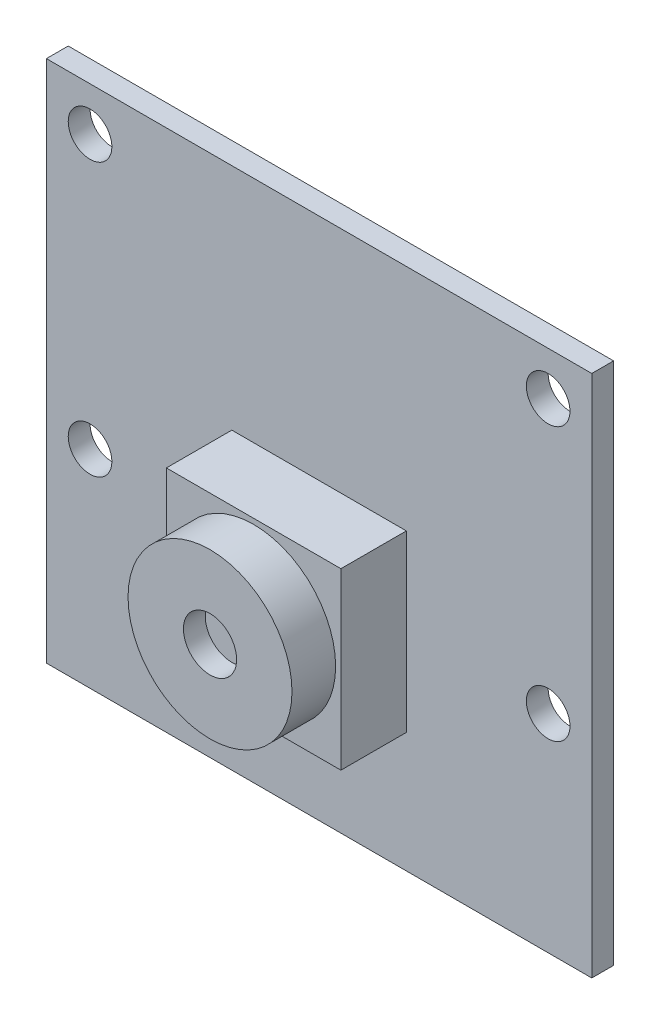
ISO-10303-21;
HEADER;
FILE_DESCRIPTION(('STEP AP214'),'2;1');
FILE_NAME('part.step','',(''),(''),'','','');
FILE_SCHEMA(('AUTOMOTIVE_DESIGN { 1 0 10303 214 1 1 1 1 }'));
ENDSEC;
DATA;
#1=APPLICATION_CONTEXT('core data for automotive mechanical design processes');
#2=APPLICATION_PROTOCOL_DEFINITION('international standard','automotive_design',2000,#1);
#3=PRODUCT_CONTEXT('',#1,'mechanical');
#4=PRODUCT('Part','Part','',(#3));
#5=PRODUCT_RELATED_PRODUCT_CATEGORY('part','',(#4));
#6=PRODUCT_DEFINITION_FORMATION('','',#4);
#7=PRODUCT_DEFINITION_CONTEXT('part definition',#1,'design');
#8=PRODUCT_DEFINITION('design','',#6,#7);
#9=PRODUCT_DEFINITION_SHAPE('','',#8);
#10=(LENGTH_UNIT() NAMED_UNIT(*) SI_UNIT(.MILLI.,.METRE.));
#11=(NAMED_UNIT(*) PLANE_ANGLE_UNIT() SI_UNIT($,.RADIAN.));
#12=(NAMED_UNIT(*) SI_UNIT($,.STERADIAN.) SOLID_ANGLE_UNIT());
#13=UNCERTAINTY_MEASURE_WITH_UNIT(LENGTH_MEASURE(1.E-05),#10,'distance_accuracy_value','');
#14=(GEOMETRIC_REPRESENTATION_CONTEXT(3) GLOBAL_UNCERTAINTY_ASSIGNED_CONTEXT((#13)) GLOBAL_UNIT_ASSIGNED_CONTEXT((#10,
#11,#12)) REPRESENTATION_CONTEXT('',''));
#15=CARTESIAN_POINT('',(0.,0.,0.));
#16=DIRECTION('',(0.,0.,1.));
#17=DIRECTION('',(1.,0.,0.));
#18=AXIS2_PLACEMENT_3D('',#15,#16,#17);
#19=CARTESIAN_POINT('',(0.,-2.50000000000002,6.));
#20=DIRECTION('',(0.,0.,-1.));
#21=DIRECTION('',(-1.,0.,0.));
#22=AXIS2_PLACEMENT_3D('',#19,#20,#21);
#23=CYLINDRICAL_SURFACE('',#22,3.75777799068408);
#24=CARTESIAN_POINT('',(0.,-2.50000000000002,6.));
#25=DIRECTION('',(0.,0.,1.));
#26=DIRECTION('',(1.,0.,0.));
#27=AXIS2_PLACEMENT_3D('',#24,#25,#26);
#28=CIRCLE('',#27,3.75777799068408);
#29=CARTESIAN_POINT('',(3.75777799068408,-2.50000000000002,6.));
#30=VERTEX_POINT('',#29);
#31=EDGE_CURVE('E11',#30,#30,#28,.T.);
#32=ORIENTED_EDGE('',*,*,#31,.F.);
#33=EDGE_LOOP('',(#32));
#34=FACE_BOUND('',#33,.T.);
#35=CARTESIAN_POINT('',(0.,-2.50000000000002,4.));
#36=DIRECTION('',(0.,0.,1.));
#37=DIRECTION('',(1.,0.,0.));
#38=AXIS2_PLACEMENT_3D('',#35,#36,#37);
#39=CIRCLE('',#38,3.75777799068408);
#40=CARTESIAN_POINT('',(3.75777799068408,-2.50000000000002,4.));
#41=VERTEX_POINT('',#40);
#42=EDGE_CURVE('E51',#41,#41,#39,.T.);
#43=ORIENTED_EDGE('',*,*,#42,.T.);
#44=EDGE_LOOP('',(#43));
#45=FACE_BOUND('',#44,.T.);
#46=ADVANCED_FACE('F48',(#34,#45),#23,.T.);
#47=CARTESIAN_POINT('',(0.,-2.50000000000002,6.));
#48=DIRECTION('',(0.,0.,1.));
#49=DIRECTION('',(1.,0.,0.));
#50=AXIS2_PLACEMENT_3D('',#47,#48,#49);
#51=PLANE('',#50);
#52=CARTESIAN_POINT('',(0.,-2.50000000000002,6.));
#53=DIRECTION('',(0.,0.,1.));
#54=DIRECTION('',(1.,0.,0.));
#55=AXIS2_PLACEMENT_3D('',#52,#53,#54);
#56=CIRCLE('',#55,1.21903368647642);
#57=CARTESIAN_POINT('',(1.21903368647642,-2.50000000000002,6.));
#58=VERTEX_POINT('',#57);
#59=EDGE_CURVE('E60',#58,#58,#56,.T.);
#60=ORIENTED_EDGE('',*,*,#59,.F.);
#61=EDGE_LOOP('',(#60));
#62=FACE_BOUND('',#61,.T.);
#63=ORIENTED_EDGE('',*,*,#31,.T.);
#64=EDGE_LOOP('',(#63));
#65=FACE_BOUND('',#64,.T.);
#66=ADVANCED_FACE('F75',(#62,#65),#51,.T.);
#67=CARTESIAN_POINT('',(0.,-2.50000000000002,4.));
#68=DIRECTION('',(0.,0.,1.));
#69=DIRECTION('',(1.,0.,0.));
#70=AXIS2_PLACEMENT_3D('',#67,#68,#69);
#71=PLANE('',#70);
#72=ORIENTED_EDGE('',*,*,#42,.F.);
#73=EDGE_LOOP('',(#72));
#74=FACE_BOUND('',#73,.T.);
#75=ADVANCED_FACE('F71',(#74),#71,.F.);
#76=CARTESIAN_POINT('',(0.,-2.50000000000002,5.));
#77=DIRECTION('',(0.,0.,1.));
#78=DIRECTION('',(1.,0.,0.));
#79=AXIS2_PLACEMENT_3D('',#76,#77,#78);
#80=CYLINDRICAL_SURFACE('',#79,1.21903368647642);
#81=CARTESIAN_POINT('',(0.,-2.50000000000002,5.));
#82=DIRECTION('',(0.,0.,1.));
#83=DIRECTION('',(1.,0.,0.));
#84=AXIS2_PLACEMENT_3D('',#81,#82,#83);
#85=CIRCLE('',#84,1.21903368647642);
#86=CARTESIAN_POINT('',(1.21903368647642,-2.50000000000002,5.));
#87=VERTEX_POINT('',#86);
#88=EDGE_CURVE('E58',#87,#87,#85,.T.);
#89=ORIENTED_EDGE('',*,*,#88,.F.);
#90=EDGE_LOOP('',(#89));
#91=FACE_BOUND('',#90,.T.);
#92=ORIENTED_EDGE('',*,*,#59,.T.);
#93=EDGE_LOOP('',(#92));
#94=FACE_BOUND('',#93,.T.);
#95=ADVANCED_FACE('F68',(#91,#94),#80,.F.);
#96=CARTESIAN_POINT('',(0.,-2.50000000000002,5.));
#97=DIRECTION('',(0.,0.,1.));
#98=DIRECTION('',(1.,0.,0.));
#99=AXIS2_PLACEMENT_3D('',#96,#97,#98);
#100=PLANE('',#99);
#101=ORIENTED_EDGE('',*,*,#88,.T.);
#102=EDGE_LOOP('',(#101));
#103=FACE_BOUND('',#102,.T.);
#104=ADVANCED_FACE('F66',(#103),#100,.T.);
#105=CLOSED_SHELL('',(#46,#66,#75,#95,#104));
#106=MANIFOLD_SOLID_BREP('B2',#105);
#107=CARTESIAN_POINT('',(4.,-6.5,4.));
#108=DIRECTION('',(-1.,0.,0.));
#109=DIRECTION('',(0.,-1.,0.));
#110=AXIS2_PLACEMENT_3D('',#107,#108,#109);
#111=PLANE('',#110);
#112=DIRECTION('',(0.,1.,0.));
#113=VECTOR('',#112,1.);
#114=CARTESIAN_POINT('',(4.,-6.5,1.));
#115=LINE('',#114,#113);
#116=CARTESIAN_POINT('',(4.,-6.5,1.));
#117=VERTEX_POINT('',#116);
#118=CARTESIAN_POINT('',(4.,1.5,1.));
#119=VERTEX_POINT('',#118);
#120=EDGE_CURVE('E191',#117,#119,#115,.T.);
#121=ORIENTED_EDGE('',*,*,#120,.T.);
#122=DIRECTION('',(0.,0.,-1.));
#123=VECTOR('',#122,1.);
#124=CARTESIAN_POINT('',(4.,1.5,4.));
#125=LINE('',#124,#123);
#126=CARTESIAN_POINT('',(4.,1.5,4.));
#127=VERTEX_POINT('',#126);
#128=EDGE_CURVE('E46',#127,#119,#125,.T.);
#129=ORIENTED_EDGE('',*,*,#128,.F.);
#130=DIRECTION('',(0.,1.,0.));
#131=VECTOR('',#130,1.);
#132=CARTESIAN_POINT('',(4.,-6.5,4.));
#133=LINE('',#132,#131);
#134=CARTESIAN_POINT('',(4.,-6.5,4.));
#135=VERTEX_POINT('',#134);
#136=EDGE_CURVE('E179',#135,#127,#133,.T.);
#137=ORIENTED_EDGE('',*,*,#136,.F.);
#138=DIRECTION('',(0.,0.,-1.));
#139=VECTOR('',#138,1.);
#140=CARTESIAN_POINT('',(4.,-6.5,4.));
#141=LINE('',#140,#139);
#142=EDGE_CURVE('E187',#135,#117,#141,.T.);
#143=ORIENTED_EDGE('',*,*,#142,.T.);
#144=EDGE_LOOP('',(#121,#129,#137,#143));
#145=FACE_BOUND('',#144,.T.);
#146=ADVANCED_FACE('F128',(#145),#111,.F.);
#147=CARTESIAN_POINT('',(-4.,1.5,4.));
#148=DIRECTION('',(0.,-1.,0.));
#149=DIRECTION('',(0.,0.,-1.));
#150=AXIS2_PLACEMENT_3D('',#147,#148,#149);
#151=PLANE('',#150);
#152=DIRECTION('',(-1.,0.,0.));
#153=VECTOR('',#152,1.);
#154=CARTESIAN_POINT('',(-4.,1.5,1.));
#155=LINE('',#154,#153);
#156=CARTESIAN_POINT('',(-4.,1.5,1.));
#157=VERTEX_POINT('',#156);
#158=EDGE_CURVE('E183',#119,#157,#155,.T.);
#159=ORIENTED_EDGE('',*,*,#158,.T.);
#160=DIRECTION('',(0.,0.,-1.));
#161=VECTOR('',#160,1.);
#162=CARTESIAN_POINT('',(-4.,1.5,4.));
#163=LINE('',#162,#161);
#164=CARTESIAN_POINT('',(-4.,1.5,4.));
#165=VERTEX_POINT('',#164);
#166=EDGE_CURVE('E136',#165,#157,#163,.T.);
#167=ORIENTED_EDGE('',*,*,#166,.F.);
#168=DIRECTION('',(-1.,0.,0.));
#169=VECTOR('',#168,1.);
#170=CARTESIAN_POINT('',(-4.,1.5,4.));
#171=LINE('',#170,#169);
#172=EDGE_CURVE('E174',#127,#165,#171,.T.);
#173=ORIENTED_EDGE('',*,*,#172,.F.);
#174=ORIENTED_EDGE('',*,*,#128,.T.);
#175=EDGE_LOOP('',(#159,#167,#173,#174));
#176=FACE_BOUND('',#175,.T.);
#177=ADVANCED_FACE('F182',(#176),#151,.F.);
#178=CARTESIAN_POINT('',(-4.,-6.5,4.));
#179=DIRECTION('',(1.,0.,0.));
#180=DIRECTION('',(0.,1.,0.));
#181=AXIS2_PLACEMENT_3D('',#178,#179,#180);
#182=PLANE('',#181);
#183=DIRECTION('',(0.,-1.,0.));
#184=VECTOR('',#183,1.);
#185=CARTESIAN_POINT('',(-4.,-6.5,1.));
#186=LINE('',#185,#184);
#187=CARTESIAN_POINT('',(-4.,-6.5,1.));
#188=VERTEX_POINT('',#187);
#189=EDGE_CURVE('E161',#157,#188,#186,.T.);
#190=ORIENTED_EDGE('',*,*,#189,.T.);
#191=DIRECTION('',(0.,0.,-1.));
#192=VECTOR('',#191,1.);
#193=CARTESIAN_POINT('',(-4.,-6.5,4.));
#194=LINE('',#193,#192);
#195=CARTESIAN_POINT('',(-4.,-6.5,4.));
#196=VERTEX_POINT('',#195);
#197=EDGE_CURVE('E184',#196,#188,#194,.T.);
#198=ORIENTED_EDGE('',*,*,#197,.F.);
#199=DIRECTION('',(0.,-1.,0.));
#200=VECTOR('',#199,1.);
#201=CARTESIAN_POINT('',(-4.,-6.5,4.));
#202=LINE('',#201,#200);
#203=EDGE_CURVE('E177',#165,#196,#202,.T.);
#204=ORIENTED_EDGE('',*,*,#203,.F.);
#205=ORIENTED_EDGE('',*,*,#166,.T.);
#206=EDGE_LOOP('',(#190,#198,#204,#205));
#207=FACE_BOUND('',#206,.T.);
#208=ADVANCED_FACE('F185',(#207),#182,.F.);
#209=CARTESIAN_POINT('',(-4.,-6.5,4.));
#210=DIRECTION('',(0.,1.,0.));
#211=DIRECTION('',(0.,0.,1.));
#212=AXIS2_PLACEMENT_3D('',#209,#210,#211);
#213=PLANE('',#212);
#214=DIRECTION('',(1.,0.,0.));
#215=VECTOR('',#214,1.);
#216=CARTESIAN_POINT('',(-4.,-6.5,1.));
#217=LINE('',#216,#215);
#218=EDGE_CURVE('E167',#188,#117,#217,.T.);
#219=ORIENTED_EDGE('',*,*,#218,.T.);
#220=ORIENTED_EDGE('',*,*,#142,.F.);
#221=DIRECTION('',(1.,0.,0.));
#222=VECTOR('',#221,1.);
#223=CARTESIAN_POINT('',(-4.,-6.5,4.));
#224=LINE('',#223,#222);
#225=EDGE_CURVE('E144',#196,#135,#224,.T.);
#226=ORIENTED_EDGE('',*,*,#225,.F.);
#227=ORIENTED_EDGE('',*,*,#197,.T.);
#228=EDGE_LOOP('',(#219,#220,#226,#227));
#229=FACE_BOUND('',#228,.T.);
#230=ADVANCED_FACE('F198',(#229),#213,.F.);
#231=CARTESIAN_POINT('',(0.,0.,4.));
#232=DIRECTION('',(0.,0.,-1.));
#233=DIRECTION('',(-1.,0.,0.));
#234=AXIS2_PLACEMENT_3D('',#231,#232,#233);
#235=PLANE('',#234);
#236=ORIENTED_EDGE('',*,*,#136,.T.);
#237=ORIENTED_EDGE('',*,*,#172,.T.);
#238=ORIENTED_EDGE('',*,*,#203,.T.);
#239=ORIENTED_EDGE('',*,*,#225,.T.);
#240=EDGE_LOOP('',(#236,#237,#238,#239));
#241=FACE_BOUND('',#240,.T.);
#242=ADVANCED_FACE('F175',(#241),#235,.F.);
#243=CARTESIAN_POINT('',(0.,0.,1.));
#244=DIRECTION('',(0.,0.,-1.));
#245=DIRECTION('',(-1.,0.,0.));
#246=AXIS2_PLACEMENT_3D('',#243,#244,#245);
#247=PLANE('',#246);
#248=ORIENTED_EDGE('',*,*,#120,.F.);
#249=ORIENTED_EDGE('',*,*,#218,.F.);
#250=ORIENTED_EDGE('',*,*,#189,.F.);
#251=ORIENTED_EDGE('',*,*,#158,.F.);
#252=EDGE_LOOP('',(#248,#249,#250,#251));
#253=FACE_BOUND('',#252,.T.);
#254=ADVANCED_FACE('F201',(#253),#247,.T.);
#255=CLOSED_SHELL('',(#146,#177,#208,#230,#242,#254));
#256=MANIFOLD_SOLID_BREP('B6',#255);
#257=CARTESIAN_POINT('',(12.5,-12.,1.));
#258=DIRECTION('',(-1.,0.,0.));
#259=DIRECTION('',(0.,0.,1.));
#260=AXIS2_PLACEMENT_3D('',#257,#258,#259);
#261=PLANE('',#260);
#262=DIRECTION('',(0.,1.,0.));
#263=VECTOR('',#262,1.);
#264=CARTESIAN_POINT('',(12.5,-12.,0.));
#265=LINE('',#264,#263);
#266=CARTESIAN_POINT('',(12.5,-12.,0.));
#267=VERTEX_POINT('',#266);
#268=CARTESIAN_POINT('',(12.5,12.,0.));
#269=VERTEX_POINT('',#268);
#270=EDGE_CURVE('E315',#267,#269,#265,.T.);
#271=ORIENTED_EDGE('',*,*,#270,.T.);
#272=DIRECTION('',(0.,0.,-1.));
#273=VECTOR('',#272,1.);
#274=CARTESIAN_POINT('',(12.5,12.,1.));
#275=LINE('',#274,#273);
#276=CARTESIAN_POINT('',(12.5,12.,1.));
#277=VERTEX_POINT('',#276);
#278=EDGE_CURVE('E126',#277,#269,#275,.T.);
#279=ORIENTED_EDGE('',*,*,#278,.F.);
#280=DIRECTION('',(0.,1.,0.));
#281=VECTOR('',#280,1.);
#282=CARTESIAN_POINT('',(12.5,-12.,1.));
#283=LINE('',#282,#281);
#284=CARTESIAN_POINT('',(12.5,-12.,1.));
#285=VERTEX_POINT('',#284);
#286=EDGE_CURVE('E303',#285,#277,#283,.T.);
#287=ORIENTED_EDGE('',*,*,#286,.F.);
#288=DIRECTION('',(0.,0.,-1.));
#289=VECTOR('',#288,1.);
#290=CARTESIAN_POINT('',(12.5,-12.,1.));
#291=LINE('',#290,#289);
#292=EDGE_CURVE('E311',#285,#267,#291,.T.);
#293=ORIENTED_EDGE('',*,*,#292,.T.);
#294=EDGE_LOOP('',(#271,#279,#287,#293));
#295=FACE_BOUND('',#294,.T.);
#296=ADVANCED_FACE('F252',(#295),#261,.F.);
#297=CARTESIAN_POINT('',(-12.5,12.,1.));
#298=DIRECTION('',(0.,-1.,0.));
#299=DIRECTION('',(0.,0.,-1.));
#300=AXIS2_PLACEMENT_3D('',#297,#298,#299);
#301=PLANE('',#300);
#302=DIRECTION('',(-1.,0.,0.));
#303=VECTOR('',#302,1.);
#304=CARTESIAN_POINT('',(-12.5,12.,0.));
#305=LINE('',#304,#303);
#306=CARTESIAN_POINT('',(-12.5,12.,0.));
#307=VERTEX_POINT('',#306);
#308=EDGE_CURVE('E307',#269,#307,#305,.T.);
#309=ORIENTED_EDGE('',*,*,#308,.T.);
#310=DIRECTION('',(0.,0.,-1.));
#311=VECTOR('',#310,1.);
#312=CARTESIAN_POINT('',(-12.5,12.,1.));
#313=LINE('',#312,#311);
#314=CARTESIAN_POINT('',(-12.5,12.,1.));
#315=VERTEX_POINT('',#314);
#316=EDGE_CURVE('E260',#315,#307,#313,.T.);
#317=ORIENTED_EDGE('',*,*,#316,.F.);
#318=DIRECTION('',(-1.,0.,0.));
#319=VECTOR('',#318,1.);
#320=CARTESIAN_POINT('',(-12.5,12.,1.));
#321=LINE('',#320,#319);
#322=EDGE_CURVE('E298',#277,#315,#321,.T.);
#323=ORIENTED_EDGE('',*,*,#322,.F.);
#324=ORIENTED_EDGE('',*,*,#278,.T.);
#325=EDGE_LOOP('',(#309,#317,#323,#324));
#326=FACE_BOUND('',#325,.T.);
#327=ADVANCED_FACE('F306',(#326),#301,.F.);
#328=CARTESIAN_POINT('',(-12.5,-12.,1.));
#329=DIRECTION('',(1.,0.,0.));
#330=DIRECTION('',(0.,0.,-1.));
#331=AXIS2_PLACEMENT_3D('',#328,#329,#330);
#332=PLANE('',#331);
#333=DIRECTION('',(0.,-1.,0.));
#334=VECTOR('',#333,1.);
#335=CARTESIAN_POINT('',(-12.5,-12.,0.));
#336=LINE('',#335,#334);
#337=CARTESIAN_POINT('',(-12.5,-12.,0.));
#338=VERTEX_POINT('',#337);
#339=EDGE_CURVE('E285',#307,#338,#336,.T.);
#340=ORIENTED_EDGE('',*,*,#339,.T.);
#341=DIRECTION('',(0.,0.,-1.));
#342=VECTOR('',#341,1.);
#343=CARTESIAN_POINT('',(-12.5,-12.,1.));
#344=LINE('',#343,#342);
#345=CARTESIAN_POINT('',(-12.5,-12.,1.));
#346=VERTEX_POINT('',#345);
#347=EDGE_CURVE('E308',#346,#338,#344,.T.);
#348=ORIENTED_EDGE('',*,*,#347,.F.);
#349=DIRECTION('',(0.,-1.,0.));
#350=VECTOR('',#349,1.);
#351=CARTESIAN_POINT('',(-12.5,-12.,1.));
#352=LINE('',#351,#350);
#353=EDGE_CURVE('E301',#315,#346,#352,.T.);
#354=ORIENTED_EDGE('',*,*,#353,.F.);
#355=ORIENTED_EDGE('',*,*,#316,.T.);
#356=EDGE_LOOP('',(#340,#348,#354,#355));
#357=FACE_BOUND('',#356,.T.);
#358=ADVANCED_FACE('F309',(#357),#332,.F.);
#359=CARTESIAN_POINT('',(-12.5,-12.,1.));
#360=DIRECTION('',(0.,1.,0.));
#361=DIRECTION('',(0.,0.,1.));
#362=AXIS2_PLACEMENT_3D('',#359,#360,#361);
#363=PLANE('',#362);
#364=DIRECTION('',(1.,0.,0.));
#365=VECTOR('',#364,1.);
#366=CARTESIAN_POINT('',(-12.5,-12.,0.));
#367=LINE('',#366,#365);
#368=EDGE_CURVE('E291',#338,#267,#367,.T.);
#369=ORIENTED_EDGE('',*,*,#368,.T.);
#370=ORIENTED_EDGE('',*,*,#292,.F.);
#371=DIRECTION('',(1.,0.,0.));
#372=VECTOR('',#371,1.);
#373=CARTESIAN_POINT('',(-12.5,-12.,1.));
#374=LINE('',#373,#372);
#375=EDGE_CURVE('E268',#346,#285,#374,.T.);
#376=ORIENTED_EDGE('',*,*,#375,.F.);
#377=ORIENTED_EDGE('',*,*,#347,.T.);
#378=EDGE_LOOP('',(#369,#370,#376,#377));
#379=FACE_BOUND('',#378,.T.);
#380=ADVANCED_FACE('F323',(#379),#363,.F.);
#381=CARTESIAN_POINT('',(0.,0.,1.));
#382=DIRECTION('',(0.,0.,-1.));
#383=DIRECTION('',(-1.,0.,0.));
#384=AXIS2_PLACEMENT_3D('',#381,#382,#383);
#385=PLANE('',#384);
#386=CARTESIAN_POINT('',(10.5,-2.49999999999999,1.));
#387=DIRECTION('',(0.,0.,-1.));
#388=DIRECTION('',(-1.,0.,0.));
#389=AXIS2_PLACEMENT_3D('',#386,#387,#388);
#390=CIRCLE('',#389,1.);
#391=CARTESIAN_POINT('',(9.50000000000001,-2.49999999999999,1.));
#392=VERTEX_POINT('',#391);
#393=EDGE_CURVE('E318',#392,#392,#390,.T.);
#394=ORIENTED_EDGE('',*,*,#393,.T.);
#395=EDGE_LOOP('',(#394));
#396=FACE_BOUND('',#395,.T.);
#397=CARTESIAN_POINT('',(10.5,10.,1.));
#398=DIRECTION('',(0.,0.,-1.));
#399=DIRECTION('',(-1.,0.,0.));
#400=AXIS2_PLACEMENT_3D('',#397,#398,#399);
#401=CIRCLE('',#400,1.);
#402=CARTESIAN_POINT('',(9.5,10.,1.));
#403=VERTEX_POINT('',#402);
#404=EDGE_CURVE('E331',#403,#403,#401,.T.);
#405=ORIENTED_EDGE('',*,*,#404,.T.);
#406=EDGE_LOOP('',(#405));
#407=FACE_BOUND('',#406,.T.);
#408=CARTESIAN_POINT('',(-10.5,10.,1.));
#409=DIRECTION('',(0.,0.,-1.));
#410=DIRECTION('',(-1.,0.,0.));
#411=AXIS2_PLACEMENT_3D('',#408,#409,#410);
#412=CIRCLE('',#411,1.);
#413=CARTESIAN_POINT('',(-11.5,10.,1.));
#414=VERTEX_POINT('',#413);
#415=EDGE_CURVE('E334',#414,#414,#412,.T.);
#416=ORIENTED_EDGE('',*,*,#415,.T.);
#417=EDGE_LOOP('',(#416));
#418=FACE_BOUND('',#417,.T.);
#419=CARTESIAN_POINT('',(-10.5,-2.5,1.));
#420=DIRECTION('',(0.,0.,-1.));
#421=DIRECTION('',(-1.,0.,0.));
#422=AXIS2_PLACEMENT_3D('',#419,#420,#421);
#423=CIRCLE('',#422,1.);
#424=CARTESIAN_POINT('',(-11.5,-2.5,1.));
#425=VERTEX_POINT('',#424);
#426=EDGE_CURVE('E337',#425,#425,#423,.T.);
#427=ORIENTED_EDGE('',*,*,#426,.T.);
#428=EDGE_LOOP('',(#427));
#429=FACE_BOUND('',#428,.T.);
#430=ORIENTED_EDGE('',*,*,#286,.T.);
#431=ORIENTED_EDGE('',*,*,#322,.T.);
#432=ORIENTED_EDGE('',*,*,#353,.T.);
#433=ORIENTED_EDGE('',*,*,#375,.T.);
#434=EDGE_LOOP('',(#430,#431,#432,#433));
#435=FACE_BOUND('',#434,.T.);
#436=ADVANCED_FACE('F299',(#396,#407,#418,#429,#435),#385,.F.);
#437=CARTESIAN_POINT('',(0.,0.,0.));
#438=DIRECTION('',(0.,0.,-1.));
#439=DIRECTION('',(-1.,0.,0.));
#440=AXIS2_PLACEMENT_3D('',#437,#438,#439);
#441=PLANE('',#440);
#442=CARTESIAN_POINT('',(10.5,-2.49999999999999,0.));
#443=DIRECTION('',(0.,0.,1.));
#444=DIRECTION('',(1.,0.,0.));
#445=AXIS2_PLACEMENT_3D('',#442,#443,#444);
#446=CIRCLE('',#445,1.);
#447=CARTESIAN_POINT('',(11.5,-2.49999999999999,0.));
#448=VERTEX_POINT('',#447);
#449=EDGE_CURVE('E344',#448,#448,#446,.T.);
#450=ORIENTED_EDGE('',*,*,#449,.T.);
#451=EDGE_LOOP('',(#450));
#452=FACE_BOUND('',#451,.T.);
#453=CARTESIAN_POINT('',(10.5,10.,0.));
#454=DIRECTION('',(0.,0.,1.));
#455=DIRECTION('',(1.,0.,0.));
#456=AXIS2_PLACEMENT_3D('',#453,#454,#455);
#457=CIRCLE('',#456,1.);
#458=CARTESIAN_POINT('',(11.5,10.,0.));
#459=VERTEX_POINT('',#458);
#460=EDGE_CURVE('E347',#459,#459,#457,.T.);
#461=ORIENTED_EDGE('',*,*,#460,.T.);
#462=EDGE_LOOP('',(#461));
#463=FACE_BOUND('',#462,.T.);
#464=CARTESIAN_POINT('',(-10.5,10.,0.));
#465=DIRECTION('',(0.,0.,1.));
#466=DIRECTION('',(1.,0.,0.));
#467=AXIS2_PLACEMENT_3D('',#464,#465,#466);
#468=CIRCLE('',#467,1.);
#469=CARTESIAN_POINT('',(-9.5,10.,0.));
#470=VERTEX_POINT('',#469);
#471=EDGE_CURVE('E343',#470,#470,#468,.T.);
#472=ORIENTED_EDGE('',*,*,#471,.T.);
#473=EDGE_LOOP('',(#472));
#474=FACE_BOUND('',#473,.T.);
#475=CARTESIAN_POINT('',(-10.5,-2.5,0.));
#476=DIRECTION('',(0.,0.,1.));
#477=DIRECTION('',(1.,0.,0.));
#478=AXIS2_PLACEMENT_3D('',#475,#476,#477);
#479=CIRCLE('',#478,1.);
#480=CARTESIAN_POINT('',(-9.5,-2.5,0.));
#481=VERTEX_POINT('',#480);
#482=EDGE_CURVE('E340',#481,#481,#479,.T.);
#483=ORIENTED_EDGE('',*,*,#482,.T.);
#484=EDGE_LOOP('',(#483));
#485=FACE_BOUND('',#484,.T.);
#486=ORIENTED_EDGE('',*,*,#270,.F.);
#487=ORIENTED_EDGE('',*,*,#368,.F.);
#488=ORIENTED_EDGE('',*,*,#339,.F.);
#489=ORIENTED_EDGE('',*,*,#308,.F.);
#490=EDGE_LOOP('',(#486,#487,#488,#489));
#491=FACE_BOUND('',#490,.T.);
#492=ADVANCED_FACE('F326',(#452,#463,#474,#485,#491),#441,.T.);
#493=CARTESIAN_POINT('',(-10.5,-2.5,0.));
#494=DIRECTION('',(0.,0.,1.));
#495=DIRECTION('',(1.,0.,0.));
#496=AXIS2_PLACEMENT_3D('',#493,#494,#495);
#497=CYLINDRICAL_SURFACE('',#496,1.);
#498=ORIENTED_EDGE('',*,*,#482,.F.);
#499=EDGE_LOOP('',(#498));
#500=FACE_BOUND('',#499,.T.);
#501=ORIENTED_EDGE('',*,*,#426,.F.);
#502=EDGE_LOOP('',(#501));
#503=FACE_BOUND('',#502,.T.);
#504=ADVANCED_FACE('F359',(#500,#503),#497,.F.);
#505=CARTESIAN_POINT('',(-10.5,10.,0.));
#506=DIRECTION('',(0.,0.,1.));
#507=DIRECTION('',(1.,0.,0.));
#508=AXIS2_PLACEMENT_3D('',#505,#506,#507);
#509=CYLINDRICAL_SURFACE('',#508,1.);
#510=ORIENTED_EDGE('',*,*,#471,.F.);
#511=EDGE_LOOP('',(#510));
#512=FACE_BOUND('',#511,.T.);
#513=ORIENTED_EDGE('',*,*,#415,.F.);
#514=EDGE_LOOP('',(#513));
#515=FACE_BOUND('',#514,.T.);
#516=ADVANCED_FACE('F355',(#512,#515),#509,.F.);
#517=CARTESIAN_POINT('',(10.5,10.,0.));
#518=DIRECTION('',(0.,0.,1.));
#519=DIRECTION('',(1.,0.,0.));
#520=AXIS2_PLACEMENT_3D('',#517,#518,#519);
#521=CYLINDRICAL_SURFACE('',#520,1.);
#522=ORIENTED_EDGE('',*,*,#460,.F.);
#523=EDGE_LOOP('',(#522));
#524=FACE_BOUND('',#523,.T.);
#525=ORIENTED_EDGE('',*,*,#404,.F.);
#526=EDGE_LOOP('',(#525));
#527=FACE_BOUND('',#526,.T.);
#528=ADVANCED_FACE('F358',(#524,#527),#521,.F.);
#529=CARTESIAN_POINT('',(10.5,-2.49999999999999,0.));
#530=DIRECTION('',(0.,0.,1.));
#531=DIRECTION('',(1.,0.,0.));
#532=AXIS2_PLACEMENT_3D('',#529,#530,#531);
#533=CYLINDRICAL_SURFACE('',#532,1.);
#534=ORIENTED_EDGE('',*,*,#449,.F.);
#535=EDGE_LOOP('',(#534));
#536=FACE_BOUND('',#535,.T.);
#537=ORIENTED_EDGE('',*,*,#393,.F.);
#538=EDGE_LOOP('',(#537));
#539=FACE_BOUND('',#538,.T.);
#540=ADVANCED_FACE('F420',(#536,#539),#533,.F.);
#541=CLOSED_SHELL('',(#296,#327,#358,#380,#436,#492,#504,#516,#528,#540));
#542=MANIFOLD_SOLID_BREP('B40',#541);
#543=ADVANCED_BREP_SHAPE_REPRESENTATION('',(#18,#106,#256,#542),#14);
#544=SHAPE_DEFINITION_REPRESENTATION(#9,#543);
ENDSEC;
END-ISO-10303-21;
